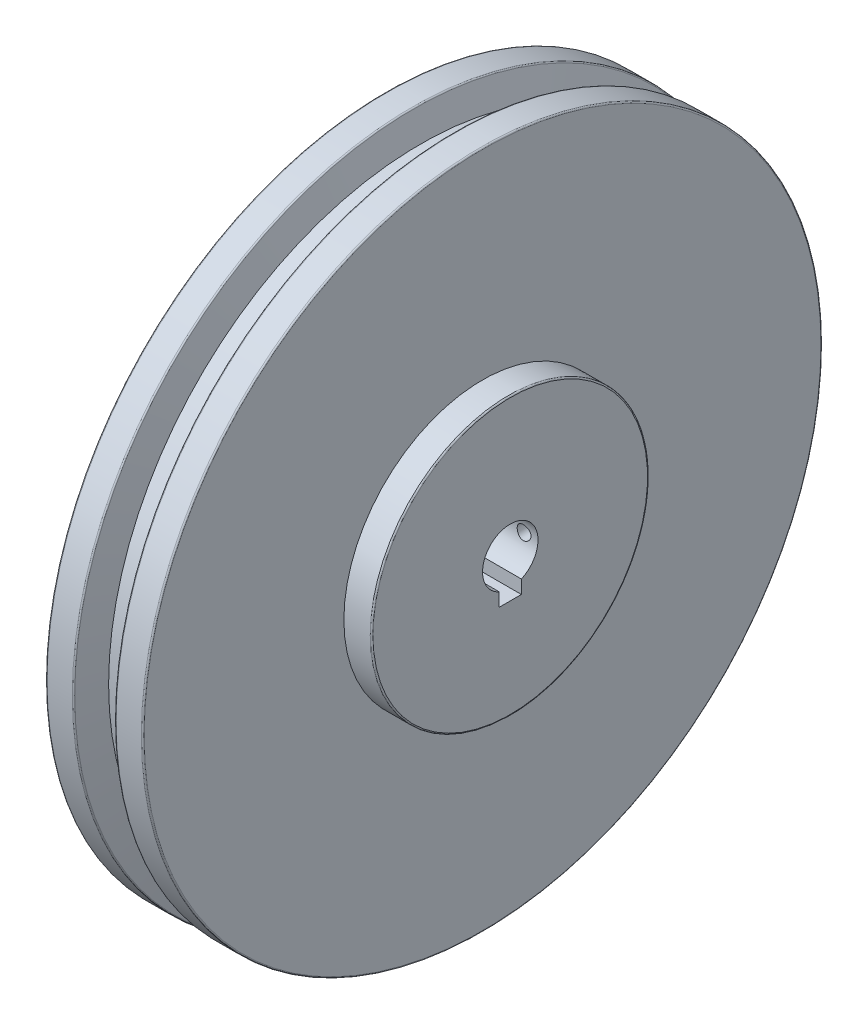
ISO-10303-21;
HEADER;
FILE_DESCRIPTION(('STEP AP214'),'2;1');
FILE_NAME('part.step','',(''),(''),'','','');
FILE_SCHEMA(('AUTOMOTIVE_DESIGN { 1 0 10303 214 1 1 1 1 }'));
ENDSEC;
DATA;
#1=APPLICATION_CONTEXT('core data for automotive mechanical design processes');
#2=APPLICATION_PROTOCOL_DEFINITION('international standard','automotive_design',2000,#1);
#3=PRODUCT_CONTEXT('',#1,'mechanical');
#4=PRODUCT('Part','Part','',(#3));
#5=PRODUCT_RELATED_PRODUCT_CATEGORY('part','',(#4));
#6=PRODUCT_DEFINITION_FORMATION('','',#4);
#7=PRODUCT_DEFINITION_CONTEXT('part definition',#1,'design');
#8=PRODUCT_DEFINITION('design','',#6,#7);
#9=PRODUCT_DEFINITION_SHAPE('','',#8);
#10=(LENGTH_UNIT() NAMED_UNIT(*) SI_UNIT(.MILLI.,.METRE.));
#11=(NAMED_UNIT(*) PLANE_ANGLE_UNIT() SI_UNIT($,.RADIAN.));
#12=(NAMED_UNIT(*) SI_UNIT($,.STERADIAN.) SOLID_ANGLE_UNIT());
#13=UNCERTAINTY_MEASURE_WITH_UNIT(LENGTH_MEASURE(1.E-05),#10,'distance_accuracy_value','');
#14=(GEOMETRIC_REPRESENTATION_CONTEXT(3) GLOBAL_UNCERTAINTY_ASSIGNED_CONTEXT((#13)) GLOBAL_UNIT_ASSIGNED_CONTEXT((#10,
#11,#12)) REPRESENTATION_CONTEXT('',''));
#15=CARTESIAN_POINT('',(0.,0.,0.));
#16=DIRECTION('',(0.,0.,1.));
#17=DIRECTION('',(1.,0.,0.));
#18=AXIS2_PLACEMENT_3D('',#15,#16,#17);
#19=CARTESIAN_POINT('',(2.5,0.,0.));
#20=DIRECTION('',(-1.,0.,0.));
#21=DIRECTION('',(0.,0.,1.));
#22=AXIS2_PLACEMENT_3D('',#19,#20,#21);
#23=CONICAL_SURFACE('',#22,10.,1.32581766366803);
#24=CARTESIAN_POINT('',(3.9982091334502,0.239497483998777,-4.));
#25=CARTESIAN_POINT('',(3.99949094210222,0.153874067113073,-4.));
#26=CARTESIAN_POINT('',(4.00008407993721,0.0682417266255501,-4.));
#27=CARTESIAN_POINT('',(3.99989702087461,-0.103020371462471,-4.));
#28=CARTESIAN_POINT('',(3.99911684151442,-0.188650129081989,-4.));
#29=CARTESIAN_POINT('',(3.99472310013969,-0.445464931331626,-4.));
#30=CARTESIAN_POINT('',(3.98905697783396,-0.616618759238255,-4.));
#31=CARTESIAN_POINT('',(3.97255266275997,-0.958361906247474,-4.));
#32=CARTESIAN_POINT('',(3.96172376166729,-1.12895168728123,-4.));
#33=CARTESIAN_POINT('',(3.9354004399075,-1.46977607446611,-4.));
#34=CARTESIAN_POINT('',(3.91990576144848,-1.64001066046866,-4.));
#35=CARTESIAN_POINT('',(3.88491349848852,-1.9795329334307,-4.));
#36=CARTESIAN_POINT('',(3.86542838707652,-2.14882192199654,-4.));
#37=CARTESIAN_POINT('',(3.8230443226964,-2.48696653471359,-4.));
#38=CARTESIAN_POINT('',(3.8001453990429,-2.65582216257344,-4.));
#39=CARTESIAN_POINT('',(3.7514931619618,-2.99321136452264,-4.));
#40=CARTESIAN_POINT('',(3.72573832003828,-3.16174471656856,-4.));
#41=CARTESIAN_POINT('',(3.67188320449087,-3.49843393520616,-4.));
#42=CARTESIAN_POINT('',(3.6437829319159,-3.66658980196661,-4.));
#43=CARTESIAN_POINT('',(3.5811609602192,-4.02856068825893,-4.));
#44=CARTESIAN_POINT('',(3.54631843748398,-4.22232001270321,-4.));
#45=CARTESIAN_POINT('',(3.47458420060922,-4.60945995883943,-4.));
#46=CARTESIAN_POINT('',(3.43769245490153,-4.80284057464985,-4.));
#47=CARTESIAN_POINT('',(3.32457410537635,-5.38252405884295,-4.));
#48=CARTESIAN_POINT('',(3.24590767658888,-5.76835006606814,-4.));
#49=CARTESIAN_POINT('',(3.08434301097601,-6.53908509686517,-4.));
#50=CARTESIAN_POINT('',(3.00144498038015,-6.92399416416948,-4.));
#51=CARTESIAN_POINT('',(2.83275823108083,-7.6931808752795,-4.));
#52=CARTESIAN_POINT('',(2.74696948235864,-8.07745851248461,-4.));
#53=CARTESIAN_POINT('',(2.57304572744791,-8.84696532269941,-4.));
#54=CARTESIAN_POINT('',(2.48490325790314,-9.23219280324941,-4.));
#55=CARTESIAN_POINT('',(2.30713409977689,-10.0023074018233,-4.));
#56=CARTESIAN_POINT('',(2.21750740089624,-10.3871945174658,-4.));
#57=CARTESIAN_POINT('',(1.94701138478034,-11.5414207532189,-4.));
#58=CARTESIAN_POINT('',(1.76451399424744,-12.3103779732623,-4.));
#59=CARTESIAN_POINT('',(1.44581148967251,-13.6434075397174,-4.));
#60=CARTESIAN_POINT('',(1.31019301606597,-14.2076207686432,-4.));
#61=CARTESIAN_POINT('',(1.03795243277761,-15.335805727838,-4.));
#62=CARTESIAN_POINT('',(0.901330322083348,-15.8997774578627,-4.));
#63=CARTESIAN_POINT('',(0.490372551565911,-17.5914572819046,-4.));
#64=CARTESIAN_POINT('',(0.214952258068573,-18.7189016820399,-4.));
#65=CARTESIAN_POINT('',(-0.335882183807941,-20.9665058719182,-4.));
#66=CARTESIAN_POINT('',(-0.611286131652636,-22.0866681655767,-4.));
#67=CARTESIAN_POINT('',(-1.02519143077604,-23.7666961745184,-4.));
#68=CARTESIAN_POINT('',(-1.16329094731863,-24.3266609305366,-4.));
#69=CARTESIAN_POINT('',(-1.4397123491927,-25.4465354051423,-4.));
#70=CARTESIAN_POINT('',(-1.57803423446698,-26.0064451237439,-4.));
#71=CARTESIAN_POINT('',(-1.71644459019244,-26.5663329597821,-4.));
#72=B_SPLINE_CURVE_WITH_KNOTS('',3,(#24,#25,#26,#27,#28,#29,#30,#31,#32,#33,#34,#35,#36,#37,#38,
#39,#40,#41,#42,#43,#44,#45,#46,#47,#48,#49,#50,#51,#52,#53,#54,#55,#56,#57,#58,#59,#60,#61,#62,
#63,#64,#65,#66,#67,#68,#69,#70,#71),.UNSPECIFIED.,.F.,.F.,(4,2,2,2,2,2,2,2,2,2,2,2,2,2,2,2,2,2,
2,2,2,2,2,4),(0.,0.256893529824105,0.513783779117827,1.02743456286781,1.54016437694349,
2.05292252538955,2.56410173536213,3.0752765560595,3.58672629165701,4.09817579852731,
4.68876292459129,5.27935915113827,6.46060795905571,7.64179925299349,8.82300281681761,
10.0085469531177,11.194099319443,13.5650403105444,15.3058902530148,17.046741951838,
20.528532750212,23.9890953920107,25.7193230936563,27.4495503503144),.UNSPECIFIED.);
#73=CARTESIAN_POINT('',(2.5,-9.16515138991168,-4.));
#74=VERTEX_POINT('',#73);
#75=CARTESIAN_POINT('',(1.35994505535974,-14.,-4.));
#76=VERTEX_POINT('',#75);
#77=EDGE_CURVE('E97',#74,#76,#72,.T.);
#78=ORIENTED_EDGE('',*,*,#77,.F.);
#79=CARTESIAN_POINT('',(2.5,0.,0.));
#80=DIRECTION('',(-1.,0.,0.));
#81=DIRECTION('',(0.,0.,1.));
#82=AXIS2_PLACEMENT_3D('',#79,#80,#81);
#83=CIRCLE('',#82,10.);
#84=CARTESIAN_POINT('',(2.5,-9.16515138991168,4.));
#85=VERTEX_POINT('',#84);
#86=EDGE_CURVE('E149',#85,#74,#83,.T.);
#87=ORIENTED_EDGE('',*,*,#86,.F.);
#88=CARTESIAN_POINT('',(-1.71644459019244,-26.5663329597821,4.));
#89=CARTESIAN_POINT('',(-1.57751969377818,-26.0043667723752,4.));
#90=CARTESIAN_POINT('',(-1.43868499306582,-25.4423783043008,4.));
#91=CARTESIAN_POINT('',(-1.16123979264955,-24.3183459035616,4.));
#92=CARTESIAN_POINT('',(-1.0226292929938,-23.7563019708847,4.));
#93=CARTESIAN_POINT('',(-0.607288678074337,-22.0704313359882,4.));
#94=CARTESIAN_POINT('',(-0.330960324651022,-20.9465055289346,4.));
#95=CARTESIAN_POINT('',(0.0821294794034745,-19.2608240092338,4.));
#96=CARTESIAN_POINT('',(0.219529000265815,-18.6992246777126,4.));
#97=CARTESIAN_POINT('',(0.493772689816105,-17.5758941779167,4.));
#98=CARTESIAN_POINT('',(0.630616862042874,-17.0141630105063,4.));
#99=CARTESIAN_POINT('',(0.903617140120429,-15.890351927177,4.));
#100=CARTESIAN_POINT('',(1.03977302333787,-15.3282719571445,4.));
#101=CARTESIAN_POINT('',(1.31109792963384,-14.2038597446444,4.));
#102=CARTESIAN_POINT('',(1.44626692946511,-13.6415274965631,4.));
#103=CARTESIAN_POINT('',(1.71190443452542,-12.5304024573386,4.));
#104=CARTESIAN_POINT('',(1.84240665654148,-11.9816177392138,4.));
#105=CARTESIAN_POINT('',(2.10150000005102,-10.8836455512106,4.));
#106=CARTESIAN_POINT('',(2.23009128117649,-10.334458119041,4.));
#107=CARTESIAN_POINT('',(2.48431808973877,-9.23591469077145,4.));
#108=CARTESIAN_POINT('',(2.60995616393847,-8.68655928729637,4.));
#109=CARTESIAN_POINT('',(2.79501440036432,-7.86167090201973,4.));
#110=CARTESIAN_POINT('',(2.85614345325827,-7.58652172450782,4.));
#111=CARTESIAN_POINT('',(2.97690982944825,-7.03589664987665,4.));
#112=CARTESIAN_POINT('',(3.03654715916062,-6.76042075416804,4.));
#113=CARTESIAN_POINT('',(3.15404729819923,-6.20820020881522,4.));
#114=CARTESIAN_POINT('',(3.21190405915624,-5.93145426811922,4.));
#115=CARTESIAN_POINT('',(3.32497988783636,-5.37742563860324,4.));
#116=CARTESIAN_POINT('',(3.38019899439789,-5.10014295774916,4.));
#117=CARTESIAN_POINT('',(3.48699754951729,-4.54513152584167,4.));
#118=CARTESIAN_POINT('',(3.5385802282393,-4.26740340063669,4.));
#119=CARTESIAN_POINT('',(3.6368012940884,-3.71103709337693,4.));
#120=CARTESIAN_POINT('',(3.68343922180667,-3.43239882923734,4.));
#121=CARTESIAN_POINT('',(3.77001140917091,-2.87304483489231,4.));
#122=CARTESIAN_POINT('',(3.80992103575625,-2.59232523808127,4.));
#123=CARTESIAN_POINT('',(3.88026936101606,-2.0297442741595,4.));
#124=CARTESIAN_POINT('',(3.91071093982709,-1.74788328073781,4.));
#125=CARTESIAN_POINT('',(3.94717948606759,-1.32385573252756,4.));
#126=CARTESIAN_POINT('',(3.95781286336694,-1.18208204216547,4.));
#127=CARTESIAN_POINT('',(3.97566723012114,-0.898319934403098,4.));
#128=CARTESIAN_POINT('',(3.9828883038966,-0.756331522395741,4.));
#129=CARTESIAN_POINT('',(3.99367170155033,-0.472061930913726,4.));
#130=CARTESIAN_POINT('',(3.99723009391394,-0.329780600766453,4.));
#131=CARTESIAN_POINT('',(4.00057456328787,-0.0451581924003093,4.));
#132=CARTESIAN_POINT('',(4.00036021993681,0.0971828907093948,4.));
#133=CARTESIAN_POINT('',(3.9982091334502,0.239497483998777,4.));
#134=B_SPLINE_CURVE_WITH_KNOTS('',3,(#88,#89,#90,#91,#92,#93,#94,#95,#96,#97,#98,#99,#100,#101,
#102,#103,#104,#105,#106,#107,#108,#109,#110,#111,#112,#113,#114,#115,#116,#117,#118,#119,#120,
#121,#122,#123,#124,#125,#126,#127,#128,#129,#130,#131,#132,#133),.UNSPECIFIED.,.F.,.F.,(4,2,2,
2,2,2,2,2,2,2,2,2,2,2,2,2,2,2,2,2,2,2,4),(0.,1.73665049204127,3.47330135715963,6.94548970452004,
8.67997845914833,10.4144561437719,12.1494629411391,13.8845104777251,15.5767725959689,
17.2688925459514,18.9594953364796,19.8050657824766,20.6506325908098,21.4988104952345,
22.3469759067211,23.194378161141,24.0418590774709,24.8923783344366,25.7426386137408,
26.1691196582863,26.5955901636103,27.0225179656139,27.4494933365723),.UNSPECIFIED.);
#135=CARTESIAN_POINT('',(1.35994505535974,-14.,4.));
#136=VERTEX_POINT('',#135);
#137=EDGE_CURVE('E69',#136,#85,#134,.T.);
#138=ORIENTED_EDGE('',*,*,#137,.F.);
#139=CARTESIAN_POINT('',(-0.594891303465912,-14.,-17.4598092532987));
#140=CARTESIAN_POINT('',(-0.477972715579384,-14.,-16.8601338890641));
#141=CARTESIAN_POINT('',(-0.363243172503584,-14.,-16.2600201503469));
#142=CARTESIAN_POINT('',(-0.139325616503206,-14.,-15.0587157594557));
#143=CARTESIAN_POINT('',(-0.0301380129904105,-14.,-14.4575250311057));
#144=CARTESIAN_POINT('',(0.181719173211806,-14.,-13.2527917699557));
#145=CARTESIAN_POINT('',(0.284375749699628,-14.,-12.6492469374648));
#146=CARTESIAN_POINT('',(0.481411871578671,-14.,-11.4408101833135));
#147=CARTESIAN_POINT('',(0.575791550070488,-14.,-10.8359182834757));
#148=CARTESIAN_POINT('',(0.753484434506258,-14.,-9.63120924080177));
#149=CARTESIAN_POINT('',(0.836906653915576,-14.,-9.03140829344529));
#150=CARTESIAN_POINT('',(0.991816572029047,-14.,-7.83027092000692));
#151=CARTESIAN_POINT('',(1.06330462555071,-14.,-7.22893454011522));
#152=CARTESIAN_POINT('',(1.19204784354924,-14.,-6.0252363726605));
#153=CARTESIAN_POINT('',(1.24931498707908,-14.,-5.42287588141449));
#154=CARTESIAN_POINT('',(1.34746133815216,-14.,-4.21680940724808));
#155=CARTESIAN_POINT('',(1.38834073742532,-14.,-3.6131034401523));
#156=CARTESIAN_POINT('',(1.45196506510539,-14.,-2.40183973962952));
#157=CARTESIAN_POINT('',(1.4746227797944,-14.,-1.79427734698979));
#158=CARTESIAN_POINT('',(1.50028301796892,-14.,-0.57873272586612));
#159=CARTESIAN_POINT('',(1.50328562343502,-14.,0.0292495008561282));
#160=CARTESIAN_POINT('',(1.4894644538347,-14.,1.24543634736847));
#161=CARTESIAN_POINT('',(1.4726259455166,-14.,1.85364079674026));
#162=CARTESIAN_POINT('',(1.42000768084097,-14.,3.06921490973008));
#163=CARTESIAN_POINT('',(1.38422793888616,-14.,3.67658457398253));
#164=CARTESIAN_POINT('',(1.29502128561865,-14.,4.89629777934016));
#165=CARTESIAN_POINT('',(1.24141639940646,-14.,5.50862811333251));
#166=CARTESIAN_POINT('',(1.11893548992387,-14.,6.73177923726777));
#167=CARTESIAN_POINT('',(1.05005846849383,-14.,7.34259992590323));
#168=CARTESIAN_POINT('',(0.899503005686127,-14.,8.56189526589394));
#169=CARTESIAN_POINT('',(0.817840208783739,-14.,9.17037186524913));
#170=CARTESIAN_POINT('',(0.687358843893016,-14.,10.081861928323));
#171=CARTESIAN_POINT('',(0.642538910998248,-14.,10.3854564619174));
#172=CARTESIAN_POINT('',(0.550477780967616,-14.,10.9922721314345));
#173=CARTESIAN_POINT('',(0.503236633691102,-14.,11.2954932749148));
#174=CARTESIAN_POINT('',(0.454905460304862,-14.,11.5985408563433));
#175=B_SPLINE_CURVE_WITH_KNOTS('',3,(#139,#140,#141,#142,#143,#144,#145,#146,#147,#148,#149,
#150,#151,#152,#153,#154,#155,#156,#157,#158,#159,#160,#161,#162,#163,#164,#165,#166,#167,#168,
#169,#170,#171,#172,#173,#174),.UNSPECIFIED.,.F.,.F.,(4,2,2,2,2,2,2,2,2,2,2,2,2,2,2,2,2,4),(0.,
1.83291351869371,3.66596224770601,5.50255396648862,7.33911614566646,9.1557408618982,
10.972311558008,12.7873468263189,14.6023608588383,16.4260111646082,18.2496538640086,
20.0746515845002,21.8996479172833,23.7434422441322,25.5873571136433,27.4290331803402,
28.3496807235931,29.2703093158355),.UNSPECIFIED.);
#176=EDGE_CURVE('E144',#76,#136,#175,.T.);
#177=ORIENTED_EDGE('',*,*,#176,.F.);
#178=EDGE_LOOP('',(#78,#87,#138,#177));
#179=FACE_BOUND('',#178,.T.);
#180=CARTESIAN_POINT('',(0.,0.,0.));
#181=DIRECTION('',(-1.,0.,0.));
#182=DIRECTION('',(0.,0.,1.));
#183=AXIS2_PLACEMENT_3D('',#180,#181,#182);
#184=CIRCLE('',#183,20.);
#185=CARTESIAN_POINT('',(0.,0.,20.));
#186=VERTEX_POINT('',#185);
#187=EDGE_CURVE('E192',#186,#186,#184,.T.);
#188=ORIENTED_EDGE('',*,*,#187,.T.);
#189=EDGE_LOOP('',(#188));
#190=FACE_BOUND('',#189,.T.);
#191=ADVANCED_FACE('F49',(#179,#190),#23,.F.);
#192=CARTESIAN_POINT('',(0.,-20.,0.));
#193=DIRECTION('',(-1.,0.,0.));
#194=DIRECTION('',(0.,0.,1.));
#195=AXIS2_PLACEMENT_3D('',#192,#193,#194);
#196=PLANE('',#195);
#197=CARTESIAN_POINT('',(0.,0.,0.));
#198=DIRECTION('',(-1.,0.,0.));
#199=DIRECTION('',(0.,0.,1.));
#200=AXIS2_PLACEMENT_3D('',#197,#198,#199);
#201=CIRCLE('',#200,122.);
#202=CARTESIAN_POINT('',(0.,0.,122.));
#203=VERTEX_POINT('',#202);
#204=EDGE_CURVE('E189',#203,#203,#201,.T.);
#205=ORIENTED_EDGE('',*,*,#204,.T.);
#206=EDGE_LOOP('',(#205));
#207=FACE_BOUND('',#206,.T.);
#208=ORIENTED_EDGE('',*,*,#187,.F.);
#209=EDGE_LOOP('',(#208));
#210=FACE_BOUND('',#209,.T.);
#211=ADVANCED_FACE('F201',(#207,#210),#196,.T.);
#212=CARTESIAN_POINT('',(0.500000000000013,0.,0.));
#213=DIRECTION('',(-1.,0.,0.));
#214=DIRECTION('',(0.,0.,1.));
#215=AXIS2_PLACEMENT_3D('',#212,#213,#214);
#216=TOROIDAL_SURFACE('',#215,122.,0.5);
#217=CARTESIAN_POINT('',(0.500000000000013,0.,0.));
#218=DIRECTION('',(-1.,0.,0.));
#219=DIRECTION('',(0.,0.,1.));
#220=AXIS2_PLACEMENT_3D('',#217,#218,#219);
#221=CIRCLE('',#220,122.5);
#222=CARTESIAN_POINT('',(0.500000000000013,0.,122.5));
#223=VERTEX_POINT('',#222);
#224=EDGE_CURVE('E186',#223,#223,#221,.T.);
#225=ORIENTED_EDGE('',*,*,#224,.T.);
#226=EDGE_LOOP('',(#225));
#227=FACE_BOUND('',#226,.T.);
#228=ORIENTED_EDGE('',*,*,#204,.F.);
#229=EDGE_LOOP('',(#228));
#230=FACE_BOUND('',#229,.T.);
#231=ADVANCED_FACE('F205',(#227,#230),#216,.T.);
#232=CARTESIAN_POINT('',(0.,0.,0.));
#233=DIRECTION('',(-1.,0.,0.));
#234=DIRECTION('',(0.,0.,1.));
#235=AXIS2_PLACEMENT_3D('',#232,#233,#234);
#236=CYLINDRICAL_SURFACE('',#235,122.5);
#237=CARTESIAN_POINT('',(9.61633650601052,0.,0.));
#238=DIRECTION('',(-1.,0.,0.));
#239=DIRECTION('',(0.,0.,1.));
#240=AXIS2_PLACEMENT_3D('',#237,#238,#239);
#241=CIRCLE('',#240,122.5);
#242=CARTESIAN_POINT('',(9.61633650601052,0.,122.5));
#243=VERTEX_POINT('',#242);
#244=EDGE_CURVE('E183',#243,#243,#241,.T.);
#245=ORIENTED_EDGE('',*,*,#244,.T.);
#246=EDGE_LOOP('',(#245));
#247=FACE_BOUND('',#246,.T.);
#248=ORIENTED_EDGE('',*,*,#224,.F.);
#249=EDGE_LOOP('',(#248));
#250=FACE_BOUND('',#249,.T.);
#251=ADVANCED_FACE('F210',(#247,#250),#236,.T.);
#252=CARTESIAN_POINT('',(9.61633650601052,0.,0.));
#253=DIRECTION('',(-1.,0.,0.));
#254=DIRECTION('',(0.,0.,1.));
#255=AXIS2_PLACEMENT_3D('',#252,#253,#254);
#256=TOROIDAL_SURFACE('',#255,122.,0.50000000000001);
#257=CARTESIAN_POINT('',(10.0992994191551,0.,0.));
#258=DIRECTION('',(-1.,0.,0.));
#259=DIRECTION('',(0.,0.,1.));
#260=AXIS2_PLACEMENT_3D('',#257,#258,#259);
#261=CIRCLE('',#260,122.129409522551);
#262=CARTESIAN_POINT('',(10.0992994191551,0.,122.129409522551));
#263=VERTEX_POINT('',#262);
#264=EDGE_CURVE('E180',#263,#263,#261,.T.);
#265=ORIENTED_EDGE('',*,*,#264,.T.);
#266=EDGE_LOOP('',(#265));
#267=FACE_BOUND('',#266,.T.);
#268=ORIENTED_EDGE('',*,*,#244,.F.);
#269=EDGE_LOOP('',(#268));
#270=FACE_BOUND('',#269,.T.);
#271=ADVANCED_FACE('F216',(#267,#270),#256,.T.);
#272=CARTESIAN_POINT('',(10.0992994191551,0.,0.));
#273=DIRECTION('',(-1.,0.,0.));
#274=DIRECTION('',(0.,0.,1.));
#275=AXIS2_PLACEMENT_3D('',#272,#273,#274);
#276=CONICAL_SURFACE('',#275,122.129409522551,1.30899693899575);
#277=CARTESIAN_POINT('',(12.6794919243112,0.,0.));
#278=DIRECTION('',(-1.,0.,0.));
#279=DIRECTION('',(0.,0.,1.));
#280=AXIS2_PLACEMENT_3D('',#277,#278,#279);
#281=CIRCLE('',#280,112.5);
#282=CARTESIAN_POINT('',(12.6794919243112,0.,112.5));
#283=VERTEX_POINT('',#282);
#284=EDGE_CURVE('E177',#283,#283,#281,.T.);
#285=ORIENTED_EDGE('',*,*,#284,.T.);
#286=EDGE_LOOP('',(#285));
#287=FACE_BOUND('',#286,.T.);
#288=ORIENTED_EDGE('',*,*,#264,.F.);
#289=EDGE_LOOP('',(#288));
#290=FACE_BOUND('',#289,.T.);
#291=ADVANCED_FACE('F220',(#287,#290),#276,.T.);
#292=CARTESIAN_POINT('',(0.,0.,0.));
#293=DIRECTION('',(-1.,0.,0.));
#294=DIRECTION('',(0.,0.,1.));
#295=AXIS2_PLACEMENT_3D('',#292,#293,#294);
#296=CYLINDRICAL_SURFACE('',#295,112.5);
#297=CARTESIAN_POINT('',(22.3205080756888,0.,0.));
#298=DIRECTION('',(-1.,0.,0.));
#299=DIRECTION('',(0.,0.,1.));
#300=AXIS2_PLACEMENT_3D('',#297,#298,#299);
#301=CIRCLE('',#300,112.5);
#302=CARTESIAN_POINT('',(22.3205080756888,0.,112.5));
#303=VERTEX_POINT('',#302);
#304=EDGE_CURVE('E174',#303,#303,#301,.T.);
#305=ORIENTED_EDGE('',*,*,#304,.T.);
#306=EDGE_LOOP('',(#305));
#307=FACE_BOUND('',#306,.T.);
#308=ORIENTED_EDGE('',*,*,#284,.F.);
#309=EDGE_LOOP('',(#308));
#310=FACE_BOUND('',#309,.T.);
#311=ADVANCED_FACE('F224',(#307,#310),#296,.T.);
#312=CARTESIAN_POINT('',(22.3205080756888,0.,0.));
#313=DIRECTION('',(1.,0.,0.));
#314=DIRECTION('',(0.,0.,-1.));
#315=AXIS2_PLACEMENT_3D('',#312,#313,#314);
#316=CONICAL_SURFACE('',#315,112.5,1.30899693899575);
#317=CARTESIAN_POINT('',(24.900700580845,0.,0.));
#318=DIRECTION('',(-1.,0.,0.));
#319=DIRECTION('',(0.,0.,1.));
#320=AXIS2_PLACEMENT_3D('',#317,#318,#319);
#321=CIRCLE('',#320,122.129409522551);
#322=CARTESIAN_POINT('',(24.900700580845,0.,122.129409522551));
#323=VERTEX_POINT('',#322);
#324=EDGE_CURVE('E171',#323,#323,#321,.T.);
#325=ORIENTED_EDGE('',*,*,#324,.T.);
#326=EDGE_LOOP('',(#325));
#327=FACE_BOUND('',#326,.T.);
#328=ORIENTED_EDGE('',*,*,#304,.F.);
#329=EDGE_LOOP('',(#328));
#330=FACE_BOUND('',#329,.T.);
#331=ADVANCED_FACE('F228',(#327,#330),#316,.T.);
#332=CARTESIAN_POINT('',(25.3836634939895,0.,0.));
#333=DIRECTION('',(-1.,0.,0.));
#334=DIRECTION('',(0.,0.,1.));
#335=AXIS2_PLACEMENT_3D('',#332,#333,#334);
#336=TOROIDAL_SURFACE('',#335,122.,0.500000000000012);
#337=CARTESIAN_POINT('',(25.3836634939895,0.,0.));
#338=DIRECTION('',(-1.,0.,0.));
#339=DIRECTION('',(0.,0.,1.));
#340=AXIS2_PLACEMENT_3D('',#337,#338,#339);
#341=CIRCLE('',#340,122.5);
#342=CARTESIAN_POINT('',(25.3836634939895,0.,122.5));
#343=VERTEX_POINT('',#342);
#344=EDGE_CURVE('E168',#343,#343,#341,.T.);
#345=ORIENTED_EDGE('',*,*,#344,.T.);
#346=EDGE_LOOP('',(#345));
#347=FACE_BOUND('',#346,.T.);
#348=ORIENTED_EDGE('',*,*,#324,.F.);
#349=EDGE_LOOP('',(#348));
#350=FACE_BOUND('',#349,.T.);
#351=ADVANCED_FACE('F232',(#347,#350),#336,.T.);
#352=CARTESIAN_POINT('',(0.,0.,0.));
#353=DIRECTION('',(-1.,0.,0.));
#354=DIRECTION('',(0.,0.,1.));
#355=AXIS2_PLACEMENT_3D('',#352,#353,#354);
#356=CYLINDRICAL_SURFACE('',#355,122.5);
#357=CARTESIAN_POINT('',(34.5,0.,0.));
#358=DIRECTION('',(-1.,0.,0.));
#359=DIRECTION('',(0.,0.,1.));
#360=AXIS2_PLACEMENT_3D('',#357,#358,#359);
#361=CIRCLE('',#360,122.5);
#362=CARTESIAN_POINT('',(34.5,0.,122.5));
#363=VERTEX_POINT('',#362);
#364=EDGE_CURVE('E165',#363,#363,#361,.T.);
#365=ORIENTED_EDGE('',*,*,#364,.T.);
#366=EDGE_LOOP('',(#365));
#367=FACE_BOUND('',#366,.T.);
#368=ORIENTED_EDGE('',*,*,#344,.F.);
#369=EDGE_LOOP('',(#368));
#370=FACE_BOUND('',#369,.T.);
#371=ADVANCED_FACE('F236',(#367,#370),#356,.T.);
#372=CARTESIAN_POINT('',(34.5,0.,0.));
#373=DIRECTION('',(-1.,0.,0.));
#374=DIRECTION('',(0.,0.,1.));
#375=AXIS2_PLACEMENT_3D('',#372,#373,#374);
#376=TOROIDAL_SURFACE('',#375,122.,0.500000000000007);
#377=CARTESIAN_POINT('',(35.,0.,0.));
#378=DIRECTION('',(-1.,0.,0.));
#379=DIRECTION('',(0.,0.,1.));
#380=AXIS2_PLACEMENT_3D('',#377,#378,#379);
#381=CIRCLE('',#380,122.);
#382=CARTESIAN_POINT('',(35.,0.,122.));
#383=VERTEX_POINT('',#382);
#384=EDGE_CURVE('E162',#383,#383,#381,.T.);
#385=ORIENTED_EDGE('',*,*,#384,.T.);
#386=EDGE_LOOP('',(#385));
#387=FACE_BOUND('',#386,.T.);
#388=ORIENTED_EDGE('',*,*,#364,.F.);
#389=EDGE_LOOP('',(#388));
#390=FACE_BOUND('',#389,.T.);
#391=ADVANCED_FACE('F240',(#387,#390),#376,.T.);
#392=CARTESIAN_POINT('',(35.,-122.,0.));
#393=DIRECTION('',(1.,0.,0.));
#394=DIRECTION('',(0.,0.,-1.));
#395=AXIS2_PLACEMENT_3D('',#392,#393,#394);
#396=PLANE('',#395);
#397=CARTESIAN_POINT('',(35.,0.,0.));
#398=DIRECTION('',(-1.,0.,0.));
#399=DIRECTION('',(0.,0.,1.));
#400=AXIS2_PLACEMENT_3D('',#397,#398,#399);
#401=CIRCLE('',#400,50.);
#402=CARTESIAN_POINT('',(35.,0.,50.));
#403=VERTEX_POINT('',#402);
#404=EDGE_CURVE('E159',#403,#403,#401,.T.);
#405=ORIENTED_EDGE('',*,*,#404,.T.);
#406=EDGE_LOOP('',(#405));
#407=FACE_BOUND('',#406,.T.);
#408=ORIENTED_EDGE('',*,*,#384,.F.);
#409=EDGE_LOOP('',(#408));
#410=FACE_BOUND('',#409,.T.);
#411=ADVANCED_FACE('F244',(#407,#410),#396,.T.);
#412=CARTESIAN_POINT('',(0.,0.,0.));
#413=DIRECTION('',(-1.,0.,0.));
#414=DIRECTION('',(0.,0.,1.));
#415=AXIS2_PLACEMENT_3D('',#412,#413,#414);
#416=CYLINDRICAL_SURFACE('',#415,50.);
#417=CARTESIAN_POINT('',(42.5,0.,-50.));
#418=CARTESIAN_POINT('',(42.4999938067327,-0.140332021138812,-49.9999991638235));
#419=CARTESIAN_POINT('',(42.488144469561,-0.280763561416726,-49.9994028803209));
#420=CARTESIAN_POINT('',(42.4410431579822,-0.557752633712622,-49.9970815115003));
#421=CARTESIAN_POINT('',(42.4057636098859,-0.694305403347967,-49.9953550962285));
#422=CARTESIAN_POINT('',(42.3128144930672,-0.9594843959425,-49.99096886511));
#423=CARTESIAN_POINT('',(42.2551563349764,-1.08811461986187,-49.9883095250188));
#424=CARTESIAN_POINT('',(42.1191042338421,-1.33383593197975,-49.9823569502755));
#425=CARTESIAN_POINT('',(42.0407151857313,-1.45092973518655,-49.9790638653117));
#426=CARTESIAN_POINT('',(41.8653383199062,-1.67040748218229,-49.9722105338841));
#427=CARTESIAN_POINT('',(41.768334127322,-1.77277833514154,-49.9686500538963));
#428=CARTESIAN_POINT('',(41.5585132524918,-1.959792697202,-49.9616652338797));
#429=CARTESIAN_POINT('',(41.4456959246213,-2.04443548214314,-49.9582408994169));
#430=CARTESIAN_POINT('',(41.207382584963,-2.1936270972365,-49.9519128668372));
#431=CARTESIAN_POINT('',(41.0818801662472,-2.25816570541253,-49.9490094338901));
#432=CARTESIAN_POINT('',(40.8218042960011,-2.36525137162032,-49.9440534611613));
#433=CARTESIAN_POINT('',(40.6872309133164,-2.40779859653844,-49.9420009149225));
#434=CARTESIAN_POINT('',(40.412953574731,-2.46965915380517,-49.9389802870907));
#435=CARTESIAN_POINT('',(40.2732540463306,-2.48899207145551,-49.9380112913821));
#436=CARTESIAN_POINT('',(39.9925894398249,-2.50393565092067,-49.9372642916764));
#437=CARTESIAN_POINT('',(39.8516243717153,-2.49954649994031,-49.9374862782806));
#438=CARTESIAN_POINT('',(39.572563292752,-2.46718685003074,-49.9390953604647));
#439=CARTESIAN_POINT('',(39.4344648211309,-2.4392375129149,-49.9404814104761));
#440=CARTESIAN_POINT('',(39.1649222149046,-2.36058366345992,-49.9442607511911));
#441=CARTESIAN_POINT('',(39.0334781084207,-2.30987905496595,-49.9466540461508));
#442=CARTESIAN_POINT('',(38.7809072781772,-2.18712981380712,-49.9521793365161));
#443=CARTESIAN_POINT('',(38.6597852508524,-2.11507553331642,-49.9553116657575));
#444=CARTESIAN_POINT('',(38.4313481582643,-1.95167933468921,-49.9619616400247));
#445=CARTESIAN_POINT('',(38.3240331904488,-1.86033728043493,-49.9654792877697));
#446=CARTESIAN_POINT('',(38.1261333251403,-1.66083897988594,-49.9725080729094));
#447=CARTESIAN_POINT('',(38.0355668998547,-1.55266440796437,-49.9760191989372));
#448=CARTESIAN_POINT('',(37.8738773110454,-1.32263615654388,-49.9826354872548));
#449=CARTESIAN_POINT('',(37.8027541523043,-1.20078247368024,-49.9857406494448));
#450=CARTESIAN_POINT('',(37.6819717944422,-0.946844175442346,-49.991195189652));
#451=CARTESIAN_POINT('',(37.6323132398878,-0.81475925297173,-49.9935445449724));
#452=CARTESIAN_POINT('',(37.5558817892509,-0.544112677123063,-49.9972223641782));
#453=CARTESIAN_POINT('',(37.5291087218414,-0.40555107223935,-49.9985508357062));
#454=CARTESIAN_POINT('',(37.4992310018786,-0.126044751802465,-50.0000361838758));
#455=CARTESIAN_POINT('',(37.4961007989827,0.0148972261366936,-50.0001943252646));
#456=CARTESIAN_POINT('',(37.513530985165,0.295304434417913,-49.9993245482275));
#457=CARTESIAN_POINT('',(37.5340912958912,0.434769669642486,-49.9982966337243));
#458=CARTESIAN_POINT('',(37.5982977298686,0.708192888031519,-49.9951713358656));
#459=CARTESIAN_POINT('',(37.6419321868822,0.842153617408628,-49.9930744929772));
#460=CARTESIAN_POINT('',(37.7510364630153,1.10084976374544,-49.9880474144383));
#461=CARTESIAN_POINT('',(37.8165064078257,1.22558512759638,-49.9851171739905));
#462=CARTESIAN_POINT('',(37.9674886220904,1.46240707974138,-49.9787497877292));
#463=CARTESIAN_POINT('',(38.0530180187967,1.57448273702701,-49.9753122096736));
#464=CARTESIAN_POINT('',(38.2416662471178,1.78269395042057,-49.9683187264821));
#465=CARTESIAN_POINT('',(38.3447851915769,1.87882940425762,-49.9647628205872));
#466=CARTESIAN_POINT('',(38.5657952604839,2.052517295267,-49.9579298631829));
#467=CARTESIAN_POINT('',(38.6836993853798,2.13005320110412,-49.9546530613978));
#468=CARTESIAN_POINT('',(38.9308672571389,2.26422804808985,-49.9487517470762));
#469=CARTESIAN_POINT('',(39.0601309545612,2.32086708018354,-49.9461272317008));
#470=CARTESIAN_POINT('',(39.3262874042272,2.41161158237647,-49.941828226878));
#471=CARTESIAN_POINT('',(39.463176555869,2.44572759126693,-49.9401532931618));
#472=CARTESIAN_POINT('',(39.740748523355,2.49049208785138,-49.9379410784838));
#473=CARTESIAN_POINT('',(39.8814313176566,2.50114070877996,-49.9374037910631));
#474=CARTESIAN_POINT('',(40.1624325394085,2.4986668860463,-49.9375276182563));
#475=CARTESIAN_POINT('',(40.3027511971354,2.48557044922552,-49.9381874217536));
#476=CARTESIAN_POINT('',(40.5791949716284,2.43603202917552,-49.9406282954506));
#477=CARTESIAN_POINT('',(40.7153200804019,2.39959000145329,-49.9424093677874));
#478=CARTESIAN_POINT('',(40.979518116491,2.30440016502862,-49.94689174356));
#479=CARTESIAN_POINT('',(41.1075909847048,2.24565219262754,-49.9495930537493));
#480=CARTESIAN_POINT('',(41.3520572084937,2.10752259891466,-49.9556113615785));
#481=CARTESIAN_POINT('',(41.4684509222735,2.02814161069473,-49.9589283403266));
#482=CARTESIAN_POINT('',(41.6863847362866,1.85090620913124,-49.965808276667));
#483=CARTESIAN_POINT('',(41.7879100859502,1.7530336681841,-49.9693714734388));
#484=CARTESIAN_POINT('',(41.9731208991199,1.54160529974551,-49.9763405609432));
#485=CARTESIAN_POINT('',(42.0568019676693,1.42804561991299,-49.9797464127612));
#486=CARTESIAN_POINT('',(42.2039879507784,1.18837737827398,-49.9860193807822));
#487=CARTESIAN_POINT('',(42.2674734564227,1.06225689682194,-49.9888859776605));
#488=CARTESIAN_POINT('',(42.3722923963538,0.801227181346139,-49.9937496510391));
#489=CARTESIAN_POINT('',(42.4136519956375,0.666328540723231,-49.9957477540503));
#490=CARTESIAN_POINT('',(42.4621963712487,0.442159815045535,-49.9981208005147));
#491=CARTESIAN_POINT('',(42.4763546331034,0.354341707021164,-49.9988224033277));
#492=CARTESIAN_POINT('',(42.4952584044629,0.177695702097406,-49.9997622676346));
#493=CARTESIAN_POINT('',(42.5000039219992,0.088867806059704,-50.000000529524));
#494=CARTESIAN_POINT('',(42.5,0.,-50.));
#495=B_SPLINE_CURVE_WITH_KNOTS('',3,(#417,#418,#419,#420,#421,#422,#423,#424,#425,#426,#427,
#428,#429,#430,#431,#432,#433,#434,#435,#436,#437,#438,#439,#440,#441,#442,#443,#444,#445,#446,
#447,#448,#449,#450,#451,#452,#453,#454,#455,#456,#457,#458,#459,#460,#461,#462,#463,#464,#465,
#466,#467,#468,#469,#470,#471,#472,#473,#474,#475,#476,#477,#478,#479,#480,#481,#482,#483,#484,
#485,#486,#487,#488,#489,#490,#491,#492,#493,#494),.UNSPECIFIED.,.T.,.F.,(4,2,2,2,2,2,2,2,2,2,2,
2,2,2,2,2,2,2,2,2,2,2,2,2,2,2,2,2,2,2,2,2,2,2,2,2,2,2,4),(0.,0.420671662760615,
0.841839269531288,1.26279240863549,1.68364624180282,2.10487199155341,2.52611494427301,
2.94757172984896,3.3690253170619,3.79012308455403,4.21121752892053,4.631934147807,
5.05265254449327,5.47356135274574,5.89447313153694,6.31584640682748,6.73721978576552,
7.15860581736525,7.57998869433066,8.00091612651078,8.42184216655598,8.84255559051737,
9.26327143626168,9.68434781573049,10.1054268966818,10.5268788587233,10.9483289865464,
11.369581772796,11.7908321674038,12.2116214650052,12.6324115645669,13.0532047522785,
13.4739850301323,13.8951799671648,14.3164785228777,14.7381807522212,15.1593831888993,
15.4257814017691,15.6921793873297),.UNSPECIFIED.);
#496=CARTESIAN_POINT('',(42.5,0.,-50.));
#497=VERTEX_POINT('',#496);
#498=EDGE_CURVE('E115',#497,#497,#495,.T.);
#499=ORIENTED_EDGE('',*,*,#498,.F.);
#500=EDGE_LOOP('',(#499));
#501=FACE_BOUND('',#500,.T.);
#502=CARTESIAN_POINT('',(44.5,0.,0.));
#503=DIRECTION('',(-1.,0.,0.));
#504=DIRECTION('',(0.,0.,1.));
#505=AXIS2_PLACEMENT_3D('',#502,#503,#504);
#506=CIRCLE('',#505,50.);
#507=CARTESIAN_POINT('',(44.5,0.,50.));
#508=VERTEX_POINT('',#507);
#509=EDGE_CURVE('E156',#508,#508,#506,.T.);
#510=ORIENTED_EDGE('',*,*,#509,.T.);
#511=EDGE_LOOP('',(#510));
#512=FACE_BOUND('',#511,.T.);
#513=ORIENTED_EDGE('',*,*,#404,.F.);
#514=EDGE_LOOP('',(#513));
#515=FACE_BOUND('',#514,.T.);
#516=ADVANCED_FACE('F247',(#501,#512,#515),#416,.T.);
#517=CARTESIAN_POINT('',(44.5,0.,0.));
#518=DIRECTION('',(-1.,0.,0.));
#519=DIRECTION('',(0.,0.,1.));
#520=AXIS2_PLACEMENT_3D('',#517,#518,#519);
#521=TOROIDAL_SURFACE('',#520,49.5,0.499999999999997);
#522=CARTESIAN_POINT('',(45.,0.,0.));
#523=DIRECTION('',(-1.,0.,0.));
#524=DIRECTION('',(0.,0.,1.));
#525=AXIS2_PLACEMENT_3D('',#522,#523,#524);
#526=CIRCLE('',#525,49.5);
#527=CARTESIAN_POINT('',(45.,0.,49.5));
#528=VERTEX_POINT('',#527);
#529=EDGE_CURVE('E153',#528,#528,#526,.T.);
#530=ORIENTED_EDGE('',*,*,#529,.T.);
#531=EDGE_LOOP('',(#530));
#532=FACE_BOUND('',#531,.T.);
#533=ORIENTED_EDGE('',*,*,#509,.F.);
#534=EDGE_LOOP('',(#533));
#535=FACE_BOUND('',#534,.T.);
#536=ADVANCED_FACE('F252',(#532,#535),#521,.T.);
#537=CARTESIAN_POINT('',(45.,-49.5,0.));
#538=DIRECTION('',(1.,0.,0.));
#539=DIRECTION('',(0.,0.,-1.));
#540=AXIS2_PLACEMENT_3D('',#537,#538,#539);
#541=PLANE('',#540);
#542=DIRECTION('',(0.,-1.,0.));
#543=VECTOR('',#542,1.);
#544=CARTESIAN_POINT('',(45.,-14.,-4.));
#545=LINE('',#544,#543);
#546=CARTESIAN_POINT('',(45.,-9.16515138991168,-4.));
#547=VERTEX_POINT('',#546);
#548=CARTESIAN_POINT('',(45.,-14.,-4.));
#549=VERTEX_POINT('',#548);
#550=EDGE_CURVE('E96',#547,#549,#545,.T.);
#551=ORIENTED_EDGE('',*,*,#550,.T.);
#552=DIRECTION('',(0.,0.,1.));
#553=VECTOR('',#552,1.);
#554=CARTESIAN_POINT('',(45.,-14.,4.));
#555=LINE('',#554,#553);
#556=CARTESIAN_POINT('',(45.,-14.,4.));
#557=VERTEX_POINT('',#556);
#558=EDGE_CURVE('E104',#549,#557,#555,.T.);
#559=ORIENTED_EDGE('',*,*,#558,.T.);
#560=DIRECTION('',(0.,1.,0.));
#561=VECTOR('',#560,1.);
#562=CARTESIAN_POINT('',(45.,-14.,4.));
#563=LINE('',#562,#561);
#564=CARTESIAN_POINT('',(45.,-9.16515138991168,4.));
#565=VERTEX_POINT('',#564);
#566=EDGE_CURVE('E101',#557,#565,#563,.T.);
#567=ORIENTED_EDGE('',*,*,#566,.T.);
#568=CARTESIAN_POINT('',(45.,0.,0.));
#569=DIRECTION('',(-1.,0.,0.));
#570=DIRECTION('',(0.,0.,1.));
#571=AXIS2_PLACEMENT_3D('',#568,#569,#570);
#572=CIRCLE('',#571,10.);
#573=EDGE_CURVE('E114',#565,#547,#572,.T.);
#574=ORIENTED_EDGE('',*,*,#573,.T.);
#575=EDGE_LOOP('',(#551,#559,#567,#574));
#576=FACE_BOUND('',#575,.T.);
#577=ORIENTED_EDGE('',*,*,#529,.F.);
#578=EDGE_LOOP('',(#577));
#579=FACE_BOUND('',#578,.T.);
#580=ADVANCED_FACE('F111',(#576,#579),#541,.T.);
#581=CARTESIAN_POINT('',(0.,0.,0.));
#582=DIRECTION('',(-1.,0.,0.));
#583=DIRECTION('',(0.,0.,1.));
#584=AXIS2_PLACEMENT_3D('',#581,#582,#583);
#585=CYLINDRICAL_SURFACE('',#584,10.);
#586=CARTESIAN_POINT('',(42.5,0.,-10.));
#587=CARTESIAN_POINT('',(42.4999961237697,0.138126814449552,-9.99999766446687));
#588=CARTESIAN_POINT('',(42.4885140820437,0.276296929717938,-9.99710963553044));
#589=CARTESIAN_POINT('',(42.442958081155,0.54867720628422,-9.98586856383157));
#590=CARTESIAN_POINT('',(42.4088713174369,0.682885078117898,-9.97751242366627));
#591=CARTESIAN_POINT('',(42.3192679108965,0.943368120304294,-9.9562604388672));
#592=CARTESIAN_POINT('',(42.2637770021412,1.06965260571667,-9.94337004736764));
#593=CARTESIAN_POINT('',(42.1330310165919,1.31112021984071,-9.91442239679369));
#594=CARTESIAN_POINT('',(42.0577752731351,1.4263029739146,-9.89836503090261));
#595=CARTESIAN_POINT('',(41.8879986839097,1.64466987883486,-9.86445689319489));
#596=CARTESIAN_POINT('',(41.7931473750683,1.74759281676842,-9.84657845246877));
#597=CARTESIAN_POINT('',(41.587579658485,1.93624821200553,-9.81122700196561));
#598=CARTESIAN_POINT('',(41.4768614617551,2.02197872824865,-9.79375403816446));
#599=CARTESIAN_POINT('',(41.240674622105,2.17504423799829,-9.76091292830281));
#600=CARTESIAN_POINT('',(41.1150112819855,2.2420870265419,-9.74557990774685));
#601=CARTESIAN_POINT('',(40.8537526472333,2.35399484758457,-9.71915824696694));
#602=CARTESIAN_POINT('',(40.7181589444466,2.39886342573357,-9.70806892824031));
#603=CARTESIAN_POINT('',(40.4437608363306,2.46425806134128,-9.69167461160538));
#604=CARTESIAN_POINT('',(40.30507517327,2.48525378055342,-9.68625818328352));
#605=CARTESIAN_POINT('',(40.0260523850011,2.50376962511068,-9.68148937432653));
#606=CARTESIAN_POINT('',(39.8857155321798,2.50129356969685,-9.68213600713214));
#607=CARTESIAN_POINT('',(39.6109736537578,2.47331087439951,-9.68932009194695));
#608=CARTESIAN_POINT('',(39.4765072975578,2.44836390031772,-9.69571438345489));
#609=CARTESIAN_POINT('',(39.2137315818149,2.37704031150499,-9.71344516118448));
#610=CARTESIAN_POINT('',(39.0854226616185,2.33066217011566,-9.72478199948731));
#611=CARTESIAN_POINT('',(38.8371033062465,2.21731579656198,-9.75125189842765));
#612=CARTESIAN_POINT('',(38.7171897136841,2.1501444453882,-9.76642212449694));
#613=CARTESIAN_POINT('',(38.4901354837386,1.99726046002491,-9.79882851409985));
#614=CARTESIAN_POINT('',(38.3829970865546,1.91154458134806,-9.81606503891047));
#615=CARTESIAN_POINT('',(38.181327307176,1.72110570780203,-9.85126467566486));
#616=CARTESIAN_POINT('',(38.0872425165644,1.61591043027643,-9.86923449130002));
#617=CARTESIAN_POINT('',(37.9179645958935,1.39101986250616,-9.90343275964594));
#618=CARTESIAN_POINT('',(37.8427720428941,1.27132412951324,-9.91966115915679));
#619=CARTESIAN_POINT('',(37.7132490229594,1.02019314780232,-9.94862886823651));
#620=CARTESIAN_POINT('',(37.658991099576,0.888718988681037,-9.96135600212879));
#621=CARTESIAN_POINT('',(37.5734711571507,0.618126680238136,-9.98179861652361));
#622=CARTESIAN_POINT('',(37.5422047393031,0.479009998584141,-9.98951505565468));
#623=CARTESIAN_POINT('',(37.5042373907353,0.200899950650046,-9.99892498785625));
#624=CARTESIAN_POINT('',(37.4969282898745,0.0619945333136841,-10.0007675584713));
#625=CARTESIAN_POINT('',(37.5054150034258,-0.215054791335847,-9.99864674690754));
#626=CARTESIAN_POINT('',(37.5212087379986,-0.353198766074326,-9.99468388736422));
#627=CARTESIAN_POINT('',(37.5749515139856,-0.622690447960817,-9.98149301878918));
#628=CARTESIAN_POINT('',(37.6125687724616,-0.754108531614584,-9.97234390309647));
#629=CARTESIAN_POINT('',(37.7085118067141,-1.00876215408753,-9.94981177723596));
#630=CARTESIAN_POINT('',(37.7668396738554,-1.13199686505442,-9.93642833949965));
#631=CARTESIAN_POINT('',(37.9037268814578,-1.36920522404972,-9.9065551321037));
#632=CARTESIAN_POINT('',(37.9826268539943,-1.48297573639294,-9.89001445611));
#633=CARTESIAN_POINT('',(38.1579831813286,-1.69587768940551,-9.85574181979587));
#634=CARTESIAN_POINT('',(38.2544425660294,-1.79500659828874,-9.83800965421578));
#635=CARTESIAN_POINT('',(38.4650032680728,-1.97831761345414,-9.80281594932498));
#636=CARTESIAN_POINT('',(38.5794795049993,-2.06207311270184,-9.78537173637464));
#637=CARTESIAN_POINT('',(38.8212210574476,-2.20918459835604,-9.75321463970069));
#638=CARTESIAN_POINT('',(38.9484858049507,-2.27254149026901,-9.73850163474941));
#639=CARTESIAN_POINT('',(39.2115095373437,-2.37658570101223,-9.71363491194665));
#640=CARTESIAN_POINT('',(39.3472127138538,-2.41740732773931,-9.70345425375809));
#641=CARTESIAN_POINT('',(39.6238493964255,-2.47557609990489,-9.68877906706586));
#642=CARTESIAN_POINT('',(39.7647817517024,-2.49292837912652,-9.68428329504045));
#643=CARTESIAN_POINT('',(40.0435350397694,-2.50339765056083,-9.68158168701612));
#644=CARTESIAN_POINT('',(40.1813290585441,-2.49719649630132,-9.68319887888035));
#645=CARTESIAN_POINT('',(40.4538398144438,-2.46229546385366,-9.69213181672143));
#646=CARTESIAN_POINT('',(40.5885566133553,-2.43359603781098,-9.69944744817732));
#647=CARTESIAN_POINT('',(40.8503474317764,-2.35488553240496,-9.71885434473222));
#648=CARTESIAN_POINT('',(40.9774621754006,-2.30500234113404,-9.73091692061057));
#649=CARTESIAN_POINT('',(41.2216089711893,-2.18544152267504,-9.7584625954084));
#650=CARTESIAN_POINT('',(41.3386396219782,-2.11576115005696,-9.77394616867808));
#651=CARTESIAN_POINT('',(41.5625910483368,-1.95644624772858,-9.80709390439338));
#652=CARTESIAN_POINT('',(41.6691684557066,-1.86633860485376,-9.82480441386302));
#653=CARTESIAN_POINT('',(41.8659117413257,-1.66964895198288,-9.86013378743769));
#654=CARTESIAN_POINT('',(41.956073716855,-1.56306303543524,-9.87775262878422));
#655=CARTESIAN_POINT('',(42.1190188476077,-1.33411264450432,-9.9112942607945));
#656=CARTESIAN_POINT('',(42.1914576894526,-1.21149737052731,-9.92718055609783));
#657=CARTESIAN_POINT('',(42.3145791049009,-0.955443432517459,-9.95508208291861));
#658=CARTESIAN_POINT('',(42.3652772677476,-0.822012605727897,-9.96710008666302));
#659=CARTESIAN_POINT('',(42.4359530505494,-0.574017088739116,-9.98413432609236));
#660=CARTESIAN_POINT('',(42.4599187384224,-0.460633618180111,-9.99004308421151));
#661=CARTESIAN_POINT('',(42.4919432393699,-0.231510119227137,-9.99797675386581));
#662=CARTESIAN_POINT('',(42.5000032488422,-0.115770268737693,-10.0000019575149));
#663=CARTESIAN_POINT('',(42.5,0.,-10.));
#664=B_SPLINE_CURVE_WITH_KNOTS('',3,(#586,#587,#588,#589,#590,#591,#592,#593,#594,#595,#596,
#597,#598,#599,#600,#601,#602,#603,#604,#605,#606,#607,#608,#609,#610,#611,#612,#613,#614,#615,
#616,#617,#618,#619,#620,#621,#622,#623,#624,#625,#626,#627,#628,#629,#630,#631,#632,#633,#634,
#635,#636,#637,#638,#639,#640,#641,#642,#643,#644,#645,#646,#647,#648,#649,#650,#651,#652,#653,
#654,#655,#656,#657,#658,#659,#660,#661,#662,#663),.UNSPECIFIED.,.T.,.F.,(4,2,2,2,2,2,2,2,2,2,2,
2,2,2,2,2,2,2,2,2,2,2,2,2,2,2,2,2,2,2,2,2,2,2,2,2,2,2,4),(0.,0.413956187453149,
0.828147062939832,1.24184150381018,1.65554990028221,2.07690725728564,2.49831215966769,
2.92597745909678,3.35357435282281,3.77260491835117,4.19156730193363,4.60037495017232,
5.00921172448932,5.42217546462,5.8352115139914,6.26002501620568,6.68485149269281,
7.11113715020725,7.5373412281994,7.95263848254329,8.36789835193439,8.77700457528931,
9.18615212209352,9.60255979281122,10.0190393835223,10.4457418201299,10.8724253125471,
11.2965375769764,11.7205570543048,12.1323963400749,12.5442273493652,12.9536066760888,
13.3630428023797,13.7831596069298,14.2033761629383,14.6312030917578,15.0587227304538,
15.4057040491338,15.752659267482),.UNSPECIFIED.);
#665=CARTESIAN_POINT('',(42.5,0.,-10.));
#666=VERTEX_POINT('',#665);
#667=EDGE_CURVE('E53',#666,#666,#664,.T.);
#668=ORIENTED_EDGE('',*,*,#667,.F.);
#669=EDGE_LOOP('',(#668));
#670=FACE_BOUND('',#669,.T.);
#671=DIRECTION('',(-1.,0.,0.));
#672=VECTOR('',#671,1.);
#673=CARTESIAN_POINT('',(0.,-9.16515138991168,-4.));
#674=LINE('',#673,#672);
#675=EDGE_CURVE('E13',#547,#74,#674,.T.);
#676=ORIENTED_EDGE('',*,*,#675,.F.);
#677=ORIENTED_EDGE('',*,*,#573,.F.);
#678=DIRECTION('',(-1.,0.,0.));
#679=VECTOR('',#678,1.);
#680=CARTESIAN_POINT('',(0.,-9.16515138991168,4.));
#681=LINE('',#680,#679);
#682=EDGE_CURVE('E62',#85,#565,#681,.F.);
#683=ORIENTED_EDGE('',*,*,#682,.F.);
#684=ORIENTED_EDGE('',*,*,#86,.T.);
#685=EDGE_LOOP('',(#676,#677,#683,#684));
#686=FACE_BOUND('',#685,.T.);
#687=ADVANCED_FACE('F197',(#670,#686),#585,.F.);
#688=CARTESIAN_POINT('',(45.,-14.,-4.));
#689=DIRECTION('',(0.,0.,-1.));
#690=DIRECTION('',(-1.,0.,0.));
#691=AXIS2_PLACEMENT_3D('',#688,#689,#690);
#692=PLANE('',#691);
#693=ORIENTED_EDGE('',*,*,#77,.T.);
#694=DIRECTION('',(-1.,0.,0.));
#695=VECTOR('',#694,1.);
#696=CARTESIAN_POINT('',(45.,-14.,-4.));
#697=LINE('',#696,#695);
#698=EDGE_CURVE('E92',#549,#76,#697,.T.);
#699=ORIENTED_EDGE('',*,*,#698,.F.);
#700=ORIENTED_EDGE('',*,*,#550,.F.);
#701=ORIENTED_EDGE('',*,*,#675,.T.);
#702=EDGE_LOOP('',(#693,#699,#700,#701));
#703=FACE_BOUND('',#702,.T.);
#704=ADVANCED_FACE('F94',(#703),#692,.F.);
#705=CARTESIAN_POINT('',(45.,-14.,4.));
#706=DIRECTION('',(0.,0.,1.));
#707=DIRECTION('',(1.,0.,0.));
#708=AXIS2_PLACEMENT_3D('',#705,#706,#707);
#709=PLANE('',#708);
#710=ORIENTED_EDGE('',*,*,#137,.T.);
#711=ORIENTED_EDGE('',*,*,#682,.T.);
#712=ORIENTED_EDGE('',*,*,#566,.F.);
#713=DIRECTION('',(-1.,0.,0.));
#714=VECTOR('',#713,1.);
#715=CARTESIAN_POINT('',(45.,-14.,4.));
#716=LINE('',#715,#714);
#717=EDGE_CURVE('E100',#557,#136,#716,.T.);
#718=ORIENTED_EDGE('',*,*,#717,.T.);
#719=EDGE_LOOP('',(#710,#711,#712,#718));
#720=FACE_BOUND('',#719,.T.);
#721=ADVANCED_FACE('F135',(#720),#709,.F.);
#722=CARTESIAN_POINT('',(45.,-14.,4.));
#723=DIRECTION('',(0.,-1.,0.));
#724=DIRECTION('',(0.,0.,-1.));
#725=AXIS2_PLACEMENT_3D('',#722,#723,#724);
#726=PLANE('',#725);
#727=ORIENTED_EDGE('',*,*,#176,.T.);
#728=ORIENTED_EDGE('',*,*,#717,.F.);
#729=ORIENTED_EDGE('',*,*,#558,.F.);
#730=ORIENTED_EDGE('',*,*,#698,.T.);
#731=EDGE_LOOP('',(#727,#728,#729,#730));
#732=FACE_BOUND('',#731,.T.);
#733=ADVANCED_FACE('F105',(#732),#726,.F.);
#734=CARTESIAN_POINT('',(40.,0.,-122.5));
#735=DIRECTION('',(0.,0.,1.));
#736=DIRECTION('',(1.,0.,0.));
#737=AXIS2_PLACEMENT_3D('',#734,#735,#736);
#738=CYLINDRICAL_SURFACE('',#737,2.5);
#739=ORIENTED_EDGE('',*,*,#498,.T.);
#740=EDGE_LOOP('',(#739));
#741=FACE_BOUND('',#740,.T.);
#742=ORIENTED_EDGE('',*,*,#667,.T.);
#743=EDGE_LOOP('',(#742));
#744=FACE_BOUND('',#743,.T.);
#745=ADVANCED_FACE('F139',(#741,#744),#738,.F.);
#746=CLOSED_SHELL('',(#191,#211,#231,#251,#271,#291,#311,#331,#351,#371,#391,#411,#516,#536,
#580,#687,#704,#721,#733,#745));
#747=MANIFOLD_SOLID_BREP('B2',#746);
#748=ADVANCED_BREP_SHAPE_REPRESENTATION('',(#18,#747),#14);
#749=SHAPE_DEFINITION_REPRESENTATION(#9,#748);
ENDSEC;
END-ISO-10303-21;
